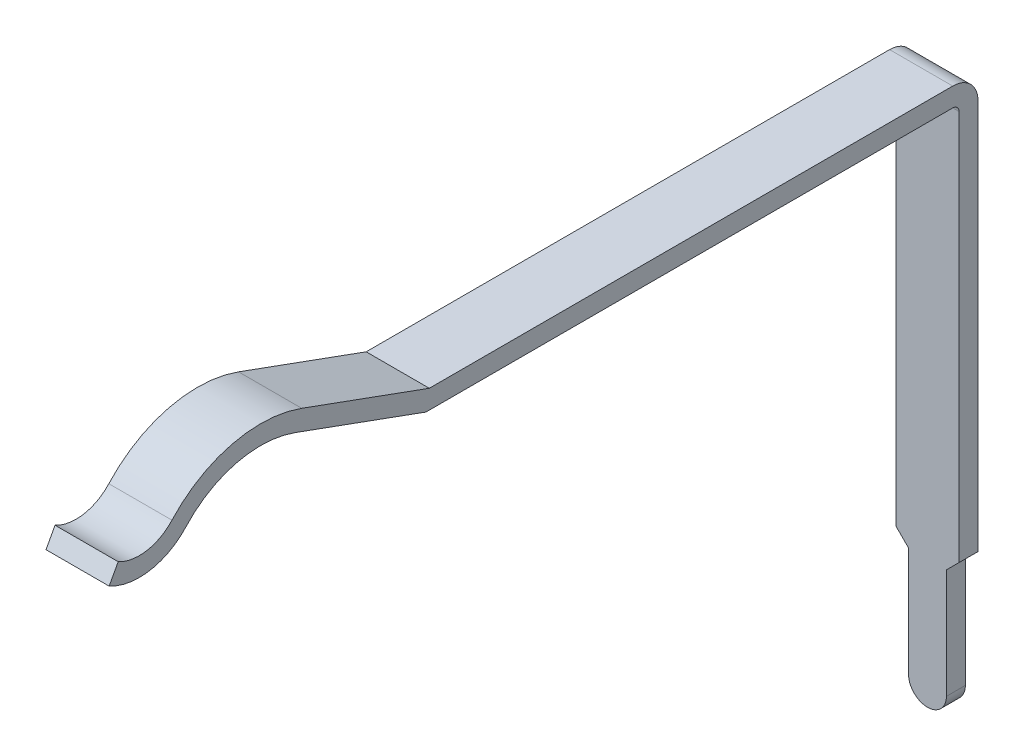
ISO-10303-21;
HEADER;
FILE_DESCRIPTION(('STEP AP214'),'2;1');
FILE_NAME('part.step','',(''),(''),'','','');
FILE_SCHEMA(('AUTOMOTIVE_DESIGN { 1 0 10303 214 1 1 1 1 }'));
ENDSEC;
DATA;
#1=APPLICATION_CONTEXT('core data for automotive mechanical design processes');
#2=APPLICATION_PROTOCOL_DEFINITION('international standard','automotive_design',2000,#1);
#3=PRODUCT_CONTEXT('',#1,'mechanical');
#4=PRODUCT('Part','Part','',(#3));
#5=PRODUCT_RELATED_PRODUCT_CATEGORY('part','',(#4));
#6=PRODUCT_DEFINITION_FORMATION('','',#4);
#7=PRODUCT_DEFINITION_CONTEXT('part definition',#1,'design');
#8=PRODUCT_DEFINITION('design','',#6,#7);
#9=PRODUCT_DEFINITION_SHAPE('','',#8);
#10=(LENGTH_UNIT() NAMED_UNIT(*) SI_UNIT(.MILLI.,.METRE.));
#11=(NAMED_UNIT(*) PLANE_ANGLE_UNIT() SI_UNIT($,.RADIAN.));
#12=(NAMED_UNIT(*) SI_UNIT($,.STERADIAN.) SOLID_ANGLE_UNIT());
#13=UNCERTAINTY_MEASURE_WITH_UNIT(LENGTH_MEASURE(1.E-05),#10,'distance_accuracy_value','');
#14=(GEOMETRIC_REPRESENTATION_CONTEXT(3) GLOBAL_UNCERTAINTY_ASSIGNED_CONTEXT((#13)) GLOBAL_UNIT_ASSIGNED_CONTEXT((#10,
#11,#12)) REPRESENTATION_CONTEXT('',''));
#15=CARTESIAN_POINT('',(0.,0.,0.));
#16=DIRECTION('',(0.,0.,1.));
#17=DIRECTION('',(1.,0.,0.));
#18=AXIS2_PLACEMENT_3D('',#15,#16,#17);
#19=CARTESIAN_POINT('',(0.5,-0.1,-14.46));
#20=DIRECTION('',(0.,0.,-1.));
#21=DIRECTION('',(-1.,0.,0.));
#22=AXIS2_PLACEMENT_3D('',#19,#20,#21);
#23=PLANE('',#22);
#24=DIRECTION('',(0.,1.,0.));
#25=VECTOR('',#24,1.);
#26=CARTESIAN_POINT('',(0.3,-0.1,-14.46));
#27=LINE('',#26,#25);
#28=CARTESIAN_POINT('',(0.3,-8.22,-14.46));
#29=VERTEX_POINT('',#28);
#30=CARTESIAN_POINT('',(0.3,-6.48526500902805,-14.46));
#31=VERTEX_POINT('',#30);
#32=EDGE_CURVE('E274',#29,#31,#27,.T.);
#33=ORIENTED_EDGE('',*,*,#32,.T.);
#34=DIRECTION('',(0.707106781186563,0.707106781186532,0.));
#35=VECTOR('',#34,1.);
#36=CARTESIAN_POINT('',(3.59263250451403,-3.19263250451416,-14.46));
#37=LINE('',#36,#35);
#38=CARTESIAN_POINT('',(0.5,-6.28526500902806,-14.46));
#39=VERTEX_POINT('',#38);
#40=EDGE_CURVE('E269',#31,#39,#37,.T.);
#41=ORIENTED_EDGE('',*,*,#40,.T.);
#42=DIRECTION('',(0.,-1.,0.));
#43=VECTOR('',#42,1.);
#44=CARTESIAN_POINT('',(0.5,-0.1,-14.46));
#45=LINE('',#44,#43);
#46=CARTESIAN_POINT('',(0.5,-0.1,-14.46));
#47=VERTEX_POINT('',#46);
#48=EDGE_CURVE('E197',#47,#39,#45,.T.);
#49=ORIENTED_EDGE('',*,*,#48,.F.);
#50=DIRECTION('',(-1.,0.,0.));
#51=VECTOR('',#50,1.);
#52=CARTESIAN_POINT('',(0.5,-0.1,-14.46));
#53=LINE('',#52,#51);
#54=CARTESIAN_POINT('',(-0.5,-0.1,-14.46));
#55=VERTEX_POINT('',#54);
#56=EDGE_CURVE('E160',#47,#55,#53,.T.);
#57=ORIENTED_EDGE('',*,*,#56,.T.);
#58=DIRECTION('',(0.,-1.,0.));
#59=VECTOR('',#58,1.);
#60=CARTESIAN_POINT('',(-0.5,-0.1,-14.46));
#61=LINE('',#60,#59);
#62=CARTESIAN_POINT('',(-0.5,-6.28526500902805,-14.46));
#63=VERTEX_POINT('',#62);
#64=EDGE_CURVE('E164',#55,#63,#61,.T.);
#65=ORIENTED_EDGE('',*,*,#64,.T.);
#66=DIRECTION('',(0.707106781186542,-0.707106781186553,0.));
#67=VECTOR('',#66,1.);
#68=CARTESIAN_POINT('',(-3.09263250451403,-3.69263250451398,-14.46));
#69=LINE('',#68,#67);
#70=CARTESIAN_POINT('',(-0.3,-6.48526500902805,-14.46));
#71=VERTEX_POINT('',#70);
#72=EDGE_CURVE('E46',#63,#71,#69,.T.);
#73=ORIENTED_EDGE('',*,*,#72,.T.);
#74=DIRECTION('',(0.,-1.,0.));
#75=VECTOR('',#74,1.);
#76=CARTESIAN_POINT('',(-0.3,-0.1,-14.46));
#77=LINE('',#76,#75);
#78=CARTESIAN_POINT('',(-0.3,-8.22,-14.46));
#79=VERTEX_POINT('',#78);
#80=EDGE_CURVE('E276',#71,#79,#77,.T.);
#81=ORIENTED_EDGE('',*,*,#80,.T.);
#82=CARTESIAN_POINT('',(0.,-8.22,-14.46));
#83=DIRECTION('',(0.,0.,-1.));
#84=DIRECTION('',(-1.,0.,0.));
#85=AXIS2_PLACEMENT_3D('',#82,#83,#84);
#86=CIRCLE('',#85,0.3);
#87=EDGE_CURVE('E168',#79,#29,#86,.F.);
#88=ORIENTED_EDGE('',*,*,#87,.T.);
#89=EDGE_LOOP('',(#33,#41,#49,#57,#65,#73,#81,#88));
#90=FACE_BOUND('',#89,.T.);
#91=ADVANCED_FACE('F32',(#90),#23,.F.);
#92=CARTESIAN_POINT('',(0.5,-0.1,-14.76));
#93=DIRECTION('',(0.,0.,-1.));
#94=DIRECTION('',(-1.,0.,0.));
#95=AXIS2_PLACEMENT_3D('',#92,#93,#94);
#96=PLANE('',#95);
#97=DIRECTION('',(-0.707106781186563,-0.707106781186532,0.));
#98=VECTOR('',#97,1.);
#99=CARTESIAN_POINT('',(0.5,-6.28526500902806,-14.76));
#100=LINE('',#99,#98);
#101=CARTESIAN_POINT('',(0.5,-6.28526500902806,-14.76));
#102=VERTEX_POINT('',#101);
#103=CARTESIAN_POINT('',(0.3,-6.48526500902805,-14.76));
#104=VERTEX_POINT('',#103);
#105=EDGE_CURVE('E300',#102,#104,#100,.T.);
#106=ORIENTED_EDGE('',*,*,#105,.T.);
#107=DIRECTION('',(0.,-1.,0.));
#108=VECTOR('',#107,1.);
#109=CARTESIAN_POINT('',(0.3,-6.48526500902805,-14.76));
#110=LINE('',#109,#108);
#111=CARTESIAN_POINT('',(0.3,-8.22,-14.76));
#112=VERTEX_POINT('',#111);
#113=EDGE_CURVE('E286',#104,#112,#110,.T.);
#114=ORIENTED_EDGE('',*,*,#113,.T.);
#115=CARTESIAN_POINT('',(0.,-8.22,-14.76));
#116=DIRECTION('',(0.,0.,-1.));
#117=DIRECTION('',(1.,0.,0.));
#118=AXIS2_PLACEMENT_3D('',#115,#116,#117);
#119=CIRCLE('',#118,0.3);
#120=CARTESIAN_POINT('',(-0.3,-8.22,-14.76));
#121=VERTEX_POINT('',#120);
#122=EDGE_CURVE('E309',#112,#121,#119,.T.);
#123=ORIENTED_EDGE('',*,*,#122,.T.);
#124=DIRECTION('',(0.,1.,0.));
#125=VECTOR('',#124,1.);
#126=CARTESIAN_POINT('',(-0.3,-8.22,-14.76));
#127=LINE('',#126,#125);
#128=CARTESIAN_POINT('',(-0.3,-6.48526500902805,-14.76));
#129=VERTEX_POINT('',#128);
#130=EDGE_CURVE('E306',#121,#129,#127,.T.);
#131=ORIENTED_EDGE('',*,*,#130,.T.);
#132=DIRECTION('',(-0.707106781186542,0.707106781186553,0.));
#133=VECTOR('',#132,1.);
#134=CARTESIAN_POINT('',(-0.3,-6.48526500902805,-14.76));
#135=LINE('',#134,#133);
#136=CARTESIAN_POINT('',(-0.5,-6.28526500902805,-14.76));
#137=VERTEX_POINT('',#136);
#138=EDGE_CURVE('E303',#129,#137,#135,.T.);
#139=ORIENTED_EDGE('',*,*,#138,.T.);
#140=DIRECTION('',(0.,1.,0.));
#141=VECTOR('',#140,1.);
#142=CARTESIAN_POINT('',(-0.5,-0.1,-14.76));
#143=LINE('',#142,#141);
#144=CARTESIAN_POINT('',(-0.5,-0.1,-14.76));
#145=VERTEX_POINT('',#144);
#146=EDGE_CURVE('E167',#145,#137,#143,.F.);
#147=ORIENTED_EDGE('',*,*,#146,.F.);
#148=DIRECTION('',(-1.,0.,0.));
#149=VECTOR('',#148,1.);
#150=CARTESIAN_POINT('',(0.5,-0.1,-14.76));
#151=LINE('',#150,#149);
#152=CARTESIAN_POINT('',(0.5,-0.1,-14.76));
#153=VERTEX_POINT('',#152);
#154=EDGE_CURVE('E11',#153,#145,#151,.T.);
#155=ORIENTED_EDGE('',*,*,#154,.F.);
#156=DIRECTION('',(0.,1.,0.));
#157=VECTOR('',#156,1.);
#158=CARTESIAN_POINT('',(0.5,-0.1,-14.76));
#159=LINE('',#158,#157);
#160=EDGE_CURVE('E239',#153,#102,#159,.F.);
#161=ORIENTED_EDGE('',*,*,#160,.T.);
#162=EDGE_LOOP('',(#106,#114,#123,#131,#139,#147,#155,#161));
#163=FACE_BOUND('',#162,.T.);
#164=ADVANCED_FACE('F313',(#163),#96,.T.);
#165=CARTESIAN_POINT('',(0.5,-0.1,-14.36));
#166=DIRECTION('',(-1.,0.,0.));
#167=DIRECTION('',(0.,0.,1.));
#168=AXIS2_PLACEMENT_3D('',#165,#166,#167);
#169=CYLINDRICAL_SURFACE('',#168,0.4);
#170=CARTESIAN_POINT('',(-0.5,-0.1,-14.36));
#171=DIRECTION('',(1.,0.,0.));
#172=DIRECTION('',(0.,0.,-1.));
#173=AXIS2_PLACEMENT_3D('',#170,#171,#172);
#174=CIRCLE('',#173,0.4);
#175=CARTESIAN_POINT('',(-0.5,0.3,-14.36));
#176=VERTEX_POINT('',#175);
#177=EDGE_CURVE('E171',#176,#145,#174,.F.);
#178=ORIENTED_EDGE('',*,*,#177,.F.);
#179=DIRECTION('',(-1.,0.,0.));
#180=VECTOR('',#179,1.);
#181=CARTESIAN_POINT('',(0.5,0.3,-14.36));
#182=LINE('',#181,#180);
#183=CARTESIAN_POINT('',(0.5,0.3,-14.36));
#184=VERTEX_POINT('',#183);
#185=EDGE_CURVE('E39',#184,#176,#182,.T.);
#186=ORIENTED_EDGE('',*,*,#185,.F.);
#187=CARTESIAN_POINT('',(0.5,-0.1,-14.36));
#188=DIRECTION('',(1.,0.,0.));
#189=DIRECTION('',(0.,0.,-1.));
#190=AXIS2_PLACEMENT_3D('',#187,#188,#189);
#191=CIRCLE('',#190,0.4);
#192=EDGE_CURVE('E235',#184,#153,#191,.F.);
#193=ORIENTED_EDGE('',*,*,#192,.T.);
#194=ORIENTED_EDGE('',*,*,#154,.T.);
#195=EDGE_LOOP('',(#178,#186,#193,#194));
#196=FACE_BOUND('',#195,.T.);
#197=ADVANCED_FACE('F223',(#196),#169,.T.);
#198=CARTESIAN_POINT('',(0.5,0.3,-6.01747897567001));
#199=DIRECTION('',(0.,1.,0.));
#200=DIRECTION('',(0.,0.,1.));
#201=AXIS2_PLACEMENT_3D('',#198,#199,#200);
#202=PLANE('',#201);
#203=DIRECTION('',(0.,0.,-1.));
#204=VECTOR('',#203,1.);
#205=CARTESIAN_POINT('',(-0.5,0.3,-6.01747897567001));
#206=LINE('',#205,#204);
#207=CARTESIAN_POINT('',(-0.5,0.3,-6.07037706988255));
#208=VERTEX_POINT('',#207);
#209=EDGE_CURVE('E174',#208,#176,#206,.T.);
#210=ORIENTED_EDGE('',*,*,#209,.F.);
#211=DIRECTION('',(-1.,0.,0.));
#212=VECTOR('',#211,1.);
#213=CARTESIAN_POINT('',(0.5,0.3,-6.07037706988255));
#214=LINE('',#213,#212);
#215=CARTESIAN_POINT('',(0.5,0.3,-6.07037706988255));
#216=VERTEX_POINT('',#215);
#217=EDGE_CURVE('E212',#216,#208,#214,.T.);
#218=ORIENTED_EDGE('',*,*,#217,.F.);
#219=DIRECTION('',(0.,0.,-1.));
#220=VECTOR('',#219,1.);
#221=CARTESIAN_POINT('',(0.5,0.3,-6.01747897567001));
#222=LINE('',#221,#220);
#223=EDGE_CURVE('E219',#216,#184,#222,.T.);
#224=ORIENTED_EDGE('',*,*,#223,.T.);
#225=ORIENTED_EDGE('',*,*,#185,.T.);
#226=EDGE_LOOP('',(#210,#218,#224,#225));
#227=FACE_BOUND('',#226,.T.);
#228=ADVANCED_FACE('F217',(#227),#202,.T.);
#229=CARTESIAN_POINT('',(0.5,1.03541597949323,-4.04983827231876));
#230=DIRECTION('',(0.,0.93969262078591,-0.342020143325664));
#231=DIRECTION('',(0.,0.342020143325664,0.93969262078591));
#232=AXIS2_PLACEMENT_3D('',#229,#230,#231);
#233=PLANE('',#232);
#234=DIRECTION('',(0.,-0.342020143325664,-0.93969262078591));
#235=VECTOR('',#234,1.);
#236=CARTESIAN_POINT('',(-0.5,1.03541597949323,-4.04983827231876));
#237=LINE('',#236,#235);
#238=CARTESIAN_POINT('',(-0.5,1.03541597949323,-4.04983827231876));
#239=VERTEX_POINT('',#238);
#240=EDGE_CURVE('E177',#239,#208,#237,.T.);
#241=ORIENTED_EDGE('',*,*,#240,.F.);
#242=DIRECTION('',(-1.,0.,0.));
#243=VECTOR('',#242,1.);
#244=CARTESIAN_POINT('',(0.5,1.03541597949323,-4.04983827231876));
#245=LINE('',#244,#243);
#246=CARTESIAN_POINT('',(0.5,1.03541597949323,-4.04983827231876));
#247=VERTEX_POINT('',#246);
#248=EDGE_CURVE('E210',#247,#239,#245,.T.);
#249=ORIENTED_EDGE('',*,*,#248,.F.);
#250=DIRECTION('',(0.,-0.342020143325664,-0.93969262078591));
#251=VECTOR('',#250,1.);
#252=CARTESIAN_POINT('',(0.5,1.03541597949323,-4.04983827231876));
#253=LINE('',#252,#251);
#254=EDGE_CURVE('E232',#247,#216,#253,.T.);
#255=ORIENTED_EDGE('',*,*,#254,.T.);
#256=ORIENTED_EDGE('',*,*,#217,.T.);
#257=EDGE_LOOP('',(#241,#249,#255,#256));
#258=FACE_BOUND('',#257,.T.);
#259=ADVANCED_FACE('F229',(#258),#233,.T.);
#260=CARTESIAN_POINT('',(0.5,-0.750000000000001,-3.4));
#261=DIRECTION('',(-1.,0.,0.));
#262=DIRECTION('',(0.,0.,1.));
#263=AXIS2_PLACEMENT_3D('',#260,#261,#262);
#264=CYLINDRICAL_SURFACE('',#263,1.9);
#265=CARTESIAN_POINT('',(-0.5,-0.750000000000001,-3.4));
#266=DIRECTION('',(1.,0.,0.));
#267=DIRECTION('',(0.,0.,-1.));
#268=AXIS2_PLACEMENT_3D('',#265,#266,#267);
#269=CIRCLE('',#268,1.9);
#270=CARTESIAN_POINT('',(-0.5,0.528846153846154,-1.99481228485554));
#271=VERTEX_POINT('',#270);
#272=EDGE_CURVE('E180',#271,#239,#269,.F.);
#273=ORIENTED_EDGE('',*,*,#272,.F.);
#274=DIRECTION('',(-1.,0.,0.));
#275=VECTOR('',#274,1.);
#276=CARTESIAN_POINT('',(0.5,0.528846153846154,-1.99481228485554));
#277=LINE('',#276,#275);
#278=CARTESIAN_POINT('',(0.5,0.528846153846154,-1.99481228485554));
#279=VERTEX_POINT('',#278);
#280=EDGE_CURVE('E208',#279,#271,#277,.T.);
#281=ORIENTED_EDGE('',*,*,#280,.F.);
#282=CARTESIAN_POINT('',(0.5,-0.750000000000001,-3.4));
#283=DIRECTION('',(1.,0.,0.));
#284=DIRECTION('',(0.,0.,-1.));
#285=AXIS2_PLACEMENT_3D('',#282,#283,#284);
#286=CIRCLE('',#285,1.9);
#287=EDGE_CURVE('E237',#279,#247,#286,.F.);
#288=ORIENTED_EDGE('',*,*,#287,.T.);
#289=ORIENTED_EDGE('',*,*,#248,.T.);
#290=EDGE_LOOP('',(#273,#281,#288,#289));
#291=FACE_BOUND('',#290,.T.);
#292=ADVANCED_FACE('F371',(#291),#264,.T.);
#293=CARTESIAN_POINT('',(0.5,1.,-1.47711154769706));
#294=DIRECTION('',(-1.,0.,0.));
#295=DIRECTION('',(0.,0.,1.));
#296=AXIS2_PLACEMENT_3D('',#293,#294,#295);
#297=CYLINDRICAL_SURFACE('',#296,0.7);
#298=CARTESIAN_POINT('',(-0.5,1.,-1.47711154769706));
#299=DIRECTION('',(1.,0.,0.));
#300=DIRECTION('',(0.,0.,-1.));
#301=AXIS2_PLACEMENT_3D('',#298,#299,#300);
#302=CIRCLE('',#301,0.7);
#303=CARTESIAN_POINT('',(-0.5,0.384810078255083,-1.14313346430912));
#304=VERTEX_POINT('',#303);
#305=EDGE_CURVE('E183',#304,#271,#302,.T.);
#306=ORIENTED_EDGE('',*,*,#305,.F.);
#307=DIRECTION('',(-1.,0.,0.));
#308=VECTOR('',#307,1.);
#309=CARTESIAN_POINT('',(0.5,0.384810078255083,-1.14313346430912));
#310=LINE('',#309,#308);
#311=CARTESIAN_POINT('',(0.5,0.384810078255083,-1.14313346430912));
#312=VERTEX_POINT('',#311);
#313=EDGE_CURVE('E206',#312,#304,#310,.T.);
#314=ORIENTED_EDGE('',*,*,#313,.F.);
#315=CARTESIAN_POINT('',(0.5,1.,-1.47711154769706));
#316=DIRECTION('',(1.,0.,0.));
#317=DIRECTION('',(0.,0.,-1.));
#318=AXIS2_PLACEMENT_3D('',#315,#316,#317);
#319=CIRCLE('',#318,0.7);
#320=EDGE_CURVE('E244',#312,#279,#319,.T.);
#321=ORIENTED_EDGE('',*,*,#320,.T.);
#322=ORIENTED_EDGE('',*,*,#280,.T.);
#323=EDGE_LOOP('',(#306,#314,#321,#322));
#324=FACE_BOUND('',#323,.T.);
#325=ADVANCED_FACE('F374',(#324),#297,.F.);
#326=CARTESIAN_POINT('',(0.5,0.121157254650118,-1.));
#327=DIRECTION('',(0.,0.477111547697058,0.878842745349882));
#328=DIRECTION('',(0.,-0.878842745349882,0.477111547697058));
#329=AXIS2_PLACEMENT_3D('',#326,#327,#328);
#330=PLANE('',#329);
#331=DIRECTION('',(0.,0.878842745349882,-0.477111547697058));
#332=VECTOR('',#331,1.);
#333=CARTESIAN_POINT('',(-0.5,0.121157254650118,-1.));
#334=LINE('',#333,#332);
#335=CARTESIAN_POINT('',(-0.5,0.121157254650118,-1.));
#336=VERTEX_POINT('',#335);
#337=EDGE_CURVE('E186',#336,#304,#334,.T.);
#338=ORIENTED_EDGE('',*,*,#337,.F.);
#339=DIRECTION('',(-1.,0.,0.));
#340=VECTOR('',#339,1.);
#341=CARTESIAN_POINT('',(0.5,0.121157254650118,-1.));
#342=LINE('',#341,#340);
#343=CARTESIAN_POINT('',(0.5,0.121157254650118,-1.));
#344=VERTEX_POINT('',#343);
#345=EDGE_CURVE('E204',#344,#336,#342,.T.);
#346=ORIENTED_EDGE('',*,*,#345,.F.);
#347=DIRECTION('',(0.,0.878842745349882,-0.477111547697058));
#348=VECTOR('',#347,1.);
#349=CARTESIAN_POINT('',(0.5,0.121157254650118,-1.));
#350=LINE('',#349,#348);
#351=EDGE_CURVE('E247',#344,#312,#350,.T.);
#352=ORIENTED_EDGE('',*,*,#351,.T.);
#353=ORIENTED_EDGE('',*,*,#313,.T.);
#354=EDGE_LOOP('',(#338,#346,#352,#353));
#355=FACE_BOUND('',#354,.T.);
#356=ADVANCED_FACE('F378',(#355),#330,.T.);
#357=CARTESIAN_POINT('',(0.5,1.,-1.47711154769706));
#358=DIRECTION('',(-1.,0.,0.));
#359=DIRECTION('',(0.,0.,1.));
#360=AXIS2_PLACEMENT_3D('',#357,#358,#359);
#361=CYLINDRICAL_SURFACE('',#360,1.);
#362=CARTESIAN_POINT('',(-0.5,1.,-1.47711154769706));
#363=DIRECTION('',(1.,0.,0.));
#364=DIRECTION('',(0.,0.,1.));
#365=AXIS2_PLACEMENT_3D('',#362,#363,#364);
#366=CIRCLE('',#365,1.);
#367=CARTESIAN_POINT('',(-0.5,0.326923076923077,-2.21668402935204));
#368=VERTEX_POINT('',#367);
#369=EDGE_CURVE('E189',#336,#368,#366,.T.);
#370=ORIENTED_EDGE('',*,*,#369,.T.);
#371=DIRECTION('',(-1.,0.,0.));
#372=VECTOR('',#371,1.);
#373=CARTESIAN_POINT('',(0.5,0.326923076923077,-2.21668402935204));
#374=LINE('',#373,#372);
#375=CARTESIAN_POINT('',(0.5,0.326923076923077,-2.21668402935204));
#376=VERTEX_POINT('',#375);
#377=EDGE_CURVE('E201',#376,#368,#374,.T.);
#378=ORIENTED_EDGE('',*,*,#377,.F.);
#379=CARTESIAN_POINT('',(0.5,1.,-1.47711154769706));
#380=DIRECTION('',(1.,0.,0.));
#381=DIRECTION('',(0.,0.,1.));
#382=AXIS2_PLACEMENT_3D('',#379,#380,#381);
#383=CIRCLE('',#382,1.);
#384=EDGE_CURVE('E250',#344,#376,#383,.T.);
#385=ORIENTED_EDGE('',*,*,#384,.F.);
#386=ORIENTED_EDGE('',*,*,#345,.T.);
#387=EDGE_LOOP('',(#370,#378,#385,#386));
#388=FACE_BOUND('',#387,.T.);
#389=ADVANCED_FACE('F256',(#388),#361,.T.);
#390=CARTESIAN_POINT('',(0.5,-0.750000000000001,-3.4));
#391=DIRECTION('',(-1.,0.,0.));
#392=DIRECTION('',(0.,0.,1.));
#393=AXIS2_PLACEMENT_3D('',#390,#391,#392);
#394=CYLINDRICAL_SURFACE('',#393,1.6);
#395=CARTESIAN_POINT('',(-0.5,-0.750000000000001,-3.4));
#396=DIRECTION('',(-1.,0.,0.));
#397=DIRECTION('',(0.,0.,-1.));
#398=AXIS2_PLACEMENT_3D('',#395,#396,#397);
#399=CIRCLE('',#398,1.6);
#400=CARTESIAN_POINT('',(-0.5,0.753508193257457,-3.94723222932106));
#401=VERTEX_POINT('',#400);
#402=EDGE_CURVE('E191',#368,#401,#399,.T.);
#403=ORIENTED_EDGE('',*,*,#402,.T.);
#404=DIRECTION('',(-1.,0.,0.));
#405=VECTOR('',#404,1.);
#406=CARTESIAN_POINT('',(0.5,0.753508193257457,-3.94723222932106));
#407=LINE('',#406,#405);
#408=CARTESIAN_POINT('',(0.5,0.753508193257457,-3.94723222932106));
#409=VERTEX_POINT('',#408);
#410=EDGE_CURVE('E155',#409,#401,#407,.T.);
#411=ORIENTED_EDGE('',*,*,#410,.F.);
#412=CARTESIAN_POINT('',(0.5,-0.750000000000001,-3.4));
#413=DIRECTION('',(-1.,0.,0.));
#414=DIRECTION('',(0.,0.,-1.));
#415=AXIS2_PLACEMENT_3D('',#412,#413,#414);
#416=CIRCLE('',#415,1.6);
#417=EDGE_CURVE('E143',#376,#409,#416,.T.);
#418=ORIENTED_EDGE('',*,*,#417,.F.);
#419=ORIENTED_EDGE('',*,*,#377,.T.);
#420=EDGE_LOOP('',(#403,#411,#418,#419));
#421=FACE_BOUND('',#420,.T.);
#422=ADVANCED_FACE('F260',(#421),#394,.F.);
#423=CARTESIAN_POINT('',(0.5,0.753508193257457,-3.94723222932106));
#424=DIRECTION('',(0.,0.93969262078591,-0.342020143325664));
#425=DIRECTION('',(0.,0.342020143325664,0.93969262078591));
#426=AXIS2_PLACEMENT_3D('',#423,#424,#425);
#427=PLANE('',#426);
#428=DIRECTION('',(0.,-0.342020143325664,-0.93969262078591));
#429=VECTOR('',#428,1.);
#430=CARTESIAN_POINT('',(-0.5,0.753508193257457,-3.94723222932106));
#431=LINE('',#430,#429);
#432=CARTESIAN_POINT('',(-0.5,0.,-6.01747897567001));
#433=VERTEX_POINT('',#432);
#434=EDGE_CURVE('E152',#401,#433,#431,.T.);
#435=ORIENTED_EDGE('',*,*,#434,.T.);
#436=DIRECTION('',(-1.,0.,0.));
#437=VECTOR('',#436,1.);
#438=CARTESIAN_POINT('',(0.5,0.,-6.01747897567001));
#439=LINE('',#438,#437);
#440=CARTESIAN_POINT('',(0.5,0.,-6.01747897567001));
#441=VERTEX_POINT('',#440);
#442=EDGE_CURVE('E149',#441,#433,#439,.T.);
#443=ORIENTED_EDGE('',*,*,#442,.F.);
#444=DIRECTION('',(0.,-0.342020143325664,-0.93969262078591));
#445=VECTOR('',#444,1.);
#446=CARTESIAN_POINT('',(0.5,0.753508193257457,-3.94723222932106));
#447=LINE('',#446,#445);
#448=EDGE_CURVE('E135',#409,#441,#447,.T.);
#449=ORIENTED_EDGE('',*,*,#448,.F.);
#450=ORIENTED_EDGE('',*,*,#410,.T.);
#451=EDGE_LOOP('',(#435,#443,#449,#450));
#452=FACE_BOUND('',#451,.T.);
#453=ADVANCED_FACE('F150',(#452),#427,.F.);
#454=CARTESIAN_POINT('',(0.5,0.,-6.01747897567001));
#455=DIRECTION('',(0.,1.,0.));
#456=DIRECTION('',(0.,0.,1.));
#457=AXIS2_PLACEMENT_3D('',#454,#455,#456);
#458=PLANE('',#457);
#459=DIRECTION('',(0.,0.,-1.));
#460=VECTOR('',#459,1.);
#461=CARTESIAN_POINT('',(-0.5,0.,-6.01747897567001));
#462=LINE('',#461,#460);
#463=CARTESIAN_POINT('',(-0.5,0.,-14.36));
#464=VERTEX_POINT('',#463);
#465=EDGE_CURVE('E194',#433,#464,#462,.T.);
#466=ORIENTED_EDGE('',*,*,#465,.T.);
#467=DIRECTION('',(-1.,0.,0.));
#468=VECTOR('',#467,1.);
#469=CARTESIAN_POINT('',(0.5,0.,-14.36));
#470=LINE('',#469,#468);
#471=CARTESIAN_POINT('',(0.5,0.,-14.36));
#472=VERTEX_POINT('',#471);
#473=EDGE_CURVE('E156',#472,#464,#470,.T.);
#474=ORIENTED_EDGE('',*,*,#473,.F.);
#475=DIRECTION('',(0.,0.,-1.));
#476=VECTOR('',#475,1.);
#477=CARTESIAN_POINT('',(0.5,0.,-6.01747897567001));
#478=LINE('',#477,#476);
#479=EDGE_CURVE('E140',#441,#472,#478,.T.);
#480=ORIENTED_EDGE('',*,*,#479,.F.);
#481=ORIENTED_EDGE('',*,*,#442,.T.);
#482=EDGE_LOOP('',(#466,#474,#480,#481));
#483=FACE_BOUND('',#482,.T.);
#484=ADVANCED_FACE('F158',(#483),#458,.F.);
#485=CARTESIAN_POINT('',(0.5,-0.1,-14.36));
#486=DIRECTION('',(-1.,0.,0.));
#487=DIRECTION('',(0.,0.,1.));
#488=AXIS2_PLACEMENT_3D('',#485,#486,#487);
#489=CYLINDRICAL_SURFACE('',#488,0.0999999999999997);
#490=CARTESIAN_POINT('',(-0.5,-0.1,-14.36));
#491=DIRECTION('',(-1.,0.,0.));
#492=DIRECTION('',(0.,0.,1.));
#493=AXIS2_PLACEMENT_3D('',#490,#491,#492);
#494=CIRCLE('',#493,0.0999999999999997);
#495=EDGE_CURVE('E99',#464,#55,#494,.T.);
#496=ORIENTED_EDGE('',*,*,#495,.T.);
#497=ORIENTED_EDGE('',*,*,#56,.F.);
#498=CARTESIAN_POINT('',(0.5,-0.1,-14.36));
#499=DIRECTION('',(-1.,0.,0.));
#500=DIRECTION('',(0.,0.,1.));
#501=AXIS2_PLACEMENT_3D('',#498,#499,#500);
#502=CIRCLE('',#501,0.0999999999999997);
#503=EDGE_CURVE('E55',#472,#47,#502,.T.);
#504=ORIENTED_EDGE('',*,*,#503,.F.);
#505=ORIENTED_EDGE('',*,*,#473,.T.);
#506=EDGE_LOOP('',(#496,#497,#504,#505));
#507=FACE_BOUND('',#506,.T.);
#508=ADVANCED_FACE('F262',(#507),#489,.F.);
#509=CARTESIAN_POINT('',(0.5,-0.1,-14.36));
#510=DIRECTION('',(1.,0.,0.));
#511=DIRECTION('',(0.,0.,-1.));
#512=AXIS2_PLACEMENT_3D('',#509,#510,#511);
#513=PLANE('',#512);
#514=DIRECTION('',(0.,0.,1.));
#515=VECTOR('',#514,1.);
#516=CARTESIAN_POINT('',(0.5,-6.28526500902806,-14.76));
#517=LINE('',#516,#515);
#518=EDGE_CURVE('E290',#102,#39,#517,.T.);
#519=ORIENTED_EDGE('',*,*,#518,.F.);
#520=ORIENTED_EDGE('',*,*,#160,.F.);
#521=ORIENTED_EDGE('',*,*,#192,.F.);
#522=ORIENTED_EDGE('',*,*,#223,.F.);
#523=ORIENTED_EDGE('',*,*,#254,.F.);
#524=ORIENTED_EDGE('',*,*,#287,.F.);
#525=ORIENTED_EDGE('',*,*,#320,.F.);
#526=ORIENTED_EDGE('',*,*,#351,.F.);
#527=ORIENTED_EDGE('',*,*,#384,.T.);
#528=ORIENTED_EDGE('',*,*,#417,.T.);
#529=ORIENTED_EDGE('',*,*,#448,.T.);
#530=ORIENTED_EDGE('',*,*,#479,.T.);
#531=ORIENTED_EDGE('',*,*,#503,.T.);
#532=ORIENTED_EDGE('',*,*,#48,.T.);
#533=EDGE_LOOP('',(#519,#520,#521,#522,#523,#524,#525,#526,#527,#528,#529,#530,#531,#532));
#534=FACE_BOUND('',#533,.T.);
#535=ADVANCED_FACE('F138',(#534),#513,.T.);
#536=CARTESIAN_POINT('',(-0.5,-0.1,-14.36));
#537=DIRECTION('',(1.,0.,0.));
#538=DIRECTION('',(0.,0.,-1.));
#539=AXIS2_PLACEMENT_3D('',#536,#537,#538);
#540=PLANE('',#539);
#541=ORIENTED_EDGE('',*,*,#146,.T.);
#542=DIRECTION('',(0.,0.,1.));
#543=VECTOR('',#542,1.);
#544=CARTESIAN_POINT('',(-0.5,-6.28526500902805,-14.76));
#545=LINE('',#544,#543);
#546=EDGE_CURVE('E288',#137,#63,#545,.T.);
#547=ORIENTED_EDGE('',*,*,#546,.T.);
#548=ORIENTED_EDGE('',*,*,#64,.F.);
#549=ORIENTED_EDGE('',*,*,#495,.F.);
#550=ORIENTED_EDGE('',*,*,#465,.F.);
#551=ORIENTED_EDGE('',*,*,#434,.F.);
#552=ORIENTED_EDGE('',*,*,#402,.F.);
#553=ORIENTED_EDGE('',*,*,#369,.F.);
#554=ORIENTED_EDGE('',*,*,#337,.T.);
#555=ORIENTED_EDGE('',*,*,#305,.T.);
#556=ORIENTED_EDGE('',*,*,#272,.T.);
#557=ORIENTED_EDGE('',*,*,#240,.T.);
#558=ORIENTED_EDGE('',*,*,#209,.T.);
#559=ORIENTED_EDGE('',*,*,#177,.T.);
#560=EDGE_LOOP('',(#541,#547,#548,#549,#550,#551,#552,#553,#554,#555,#556,#557,#558,#559));
#561=FACE_BOUND('',#560,.T.);
#562=ADVANCED_FACE('F225',(#561),#540,.F.);
#563=CARTESIAN_POINT('',(0.,-8.22,-14.76));
#564=DIRECTION('',(0.,0.,1.));
#565=DIRECTION('',(1.,0.,0.));
#566=AXIS2_PLACEMENT_3D('',#563,#564,#565);
#567=CYLINDRICAL_SURFACE('',#566,0.3);
#568=DIRECTION('',(0.,0.,1.));
#569=VECTOR('',#568,1.);
#570=CARTESIAN_POINT('',(-0.3,-8.22,-14.76));
#571=LINE('',#570,#569);
#572=EDGE_CURVE('E282',#121,#79,#571,.T.);
#573=ORIENTED_EDGE('',*,*,#572,.F.);
#574=ORIENTED_EDGE('',*,*,#122,.F.);
#575=DIRECTION('',(0.,0.,1.));
#576=VECTOR('',#575,1.);
#577=CARTESIAN_POINT('',(0.3,-8.22,-14.76));
#578=LINE('',#577,#576);
#579=EDGE_CURVE('E281',#112,#29,#578,.T.);
#580=ORIENTED_EDGE('',*,*,#579,.T.);
#581=ORIENTED_EDGE('',*,*,#87,.F.);
#582=EDGE_LOOP('',(#573,#574,#580,#581));
#583=FACE_BOUND('',#582,.T.);
#584=ADVANCED_FACE('F322',(#583),#567,.T.);
#585=CARTESIAN_POINT('',(0.3,-6.48526500902805,-14.76));
#586=DIRECTION('',(-1.,0.,0.));
#587=DIRECTION('',(0.,-1.,0.));
#588=AXIS2_PLACEMENT_3D('',#585,#586,#587);
#589=PLANE('',#588);
#590=ORIENTED_EDGE('',*,*,#579,.F.);
#591=ORIENTED_EDGE('',*,*,#113,.F.);
#592=DIRECTION('',(0.,0.,1.));
#593=VECTOR('',#592,1.);
#594=CARTESIAN_POINT('',(0.3,-6.48526500902805,-14.76));
#595=LINE('',#594,#593);
#596=EDGE_CURVE('E293',#104,#31,#595,.T.);
#597=ORIENTED_EDGE('',*,*,#596,.T.);
#598=ORIENTED_EDGE('',*,*,#32,.F.);
#599=EDGE_LOOP('',(#590,#591,#597,#598));
#600=FACE_BOUND('',#599,.T.);
#601=ADVANCED_FACE('F329',(#600),#589,.F.);
#602=CARTESIAN_POINT('',(-0.3,-8.22,-14.76));
#603=DIRECTION('',(1.,0.,0.));
#604=DIRECTION('',(0.,0.,-1.));
#605=AXIS2_PLACEMENT_3D('',#602,#603,#604);
#606=PLANE('',#605);
#607=DIRECTION('',(0.,0.,1.));
#608=VECTOR('',#607,1.);
#609=CARTESIAN_POINT('',(-0.3,-6.48526500902805,-14.76));
#610=LINE('',#609,#608);
#611=EDGE_CURVE('E285',#129,#71,#610,.T.);
#612=ORIENTED_EDGE('',*,*,#611,.F.);
#613=ORIENTED_EDGE('',*,*,#130,.F.);
#614=ORIENTED_EDGE('',*,*,#572,.T.);
#615=ORIENTED_EDGE('',*,*,#80,.F.);
#616=EDGE_LOOP('',(#612,#613,#614,#615));
#617=FACE_BOUND('',#616,.T.);
#618=ADVANCED_FACE('F348',(#617),#606,.F.);
#619=CARTESIAN_POINT('',(0.5,-6.28526500902806,-14.76));
#620=DIRECTION('',(-0.707106781186532,0.707106781186563,0.));
#621=DIRECTION('',(-0.707106781186563,-0.707106781186532,0.));
#622=AXIS2_PLACEMENT_3D('',#619,#620,#621);
#623=PLANE('',#622);
#624=ORIENTED_EDGE('',*,*,#596,.F.);
#625=ORIENTED_EDGE('',*,*,#105,.F.);
#626=ORIENTED_EDGE('',*,*,#518,.T.);
#627=ORIENTED_EDGE('',*,*,#40,.F.);
#628=EDGE_LOOP('',(#624,#625,#626,#627));
#629=FACE_BOUND('',#628,.T.);
#630=ADVANCED_FACE('F351',(#629),#623,.F.);
#631=CARTESIAN_POINT('',(-0.3,-6.48526500902805,-14.76));
#632=DIRECTION('',(0.707106781186553,0.707106781186542,0.));
#633=DIRECTION('',(-0.707106781186542,0.707106781186553,0.));
#634=AXIS2_PLACEMENT_3D('',#631,#632,#633);
#635=PLANE('',#634);
#636=ORIENTED_EDGE('',*,*,#546,.F.);
#637=ORIENTED_EDGE('',*,*,#138,.F.);
#638=ORIENTED_EDGE('',*,*,#611,.T.);
#639=ORIENTED_EDGE('',*,*,#72,.F.);
#640=EDGE_LOOP('',(#636,#637,#638,#639));
#641=FACE_BOUND('',#640,.T.);
#642=ADVANCED_FACE('F349',(#641),#635,.F.);
#643=CLOSED_SHELL('',(#91,#164,#197,#228,#259,#292,#325,#356,#389,#422,#453,#484,#508,#535,#562,
#584,#601,#618,#630,#642));
#644=MANIFOLD_SOLID_BREP('B2',#643);
#645=ADVANCED_BREP_SHAPE_REPRESENTATION('',(#18,#644),#14);
#646=SHAPE_DEFINITION_REPRESENTATION(#9,#645);
ENDSEC;
END-ISO-10303-21;
